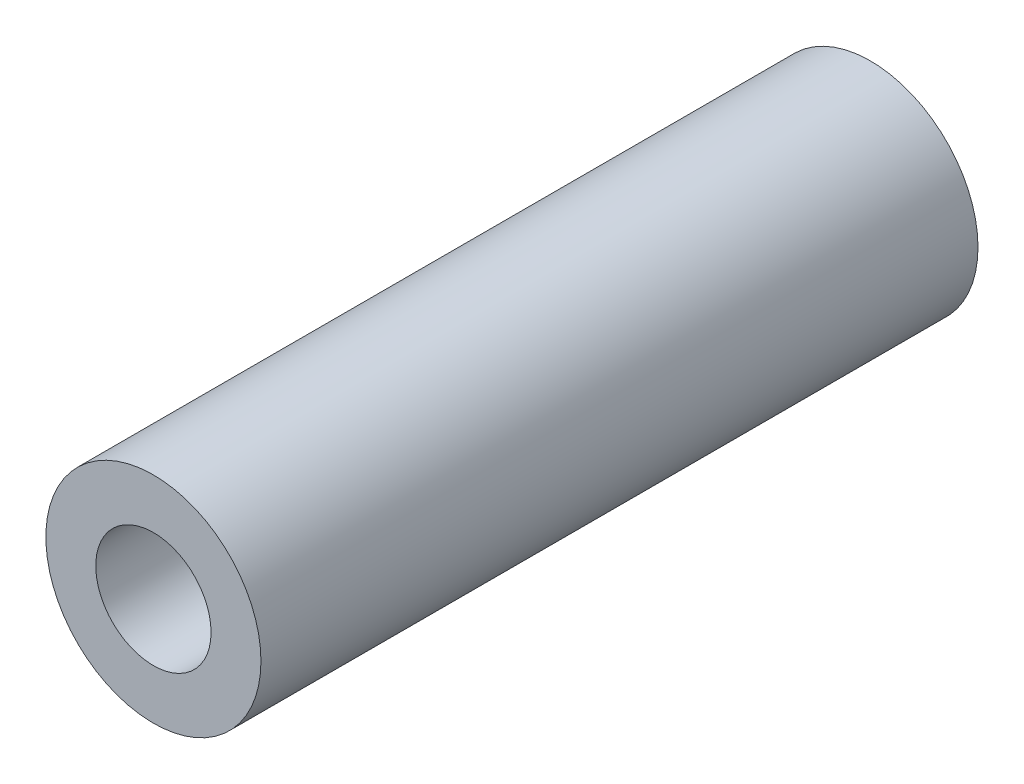
ISO-10303-21;
HEADER;
FILE_DESCRIPTION(('STEP AP214'),'2;1');
FILE_NAME('part.step','',(''),(''),'','','');
FILE_SCHEMA(('AUTOMOTIVE_DESIGN { 1 0 10303 214 1 1 1 1 }'));
ENDSEC;
DATA;
#1=APPLICATION_CONTEXT('core data for automotive mechanical design processes');
#2=APPLICATION_PROTOCOL_DEFINITION('international standard','automotive_design',2000,#1);
#3=PRODUCT_CONTEXT('',#1,'mechanical');
#4=PRODUCT('Part','Part','',(#3));
#5=PRODUCT_RELATED_PRODUCT_CATEGORY('part','',(#4));
#6=PRODUCT_DEFINITION_FORMATION('','',#4);
#7=PRODUCT_DEFINITION_CONTEXT('part definition',#1,'design');
#8=PRODUCT_DEFINITION('design','',#6,#7);
#9=PRODUCT_DEFINITION_SHAPE('','',#8);
#10=(LENGTH_UNIT() NAMED_UNIT(*) SI_UNIT(.MILLI.,.METRE.));
#11=(NAMED_UNIT(*) PLANE_ANGLE_UNIT() SI_UNIT($,.RADIAN.));
#12=(NAMED_UNIT(*) SI_UNIT($,.STERADIAN.) SOLID_ANGLE_UNIT());
#13=UNCERTAINTY_MEASURE_WITH_UNIT(LENGTH_MEASURE(1.E-05),#10,'distance_accuracy_value','');
#14=(GEOMETRIC_REPRESENTATION_CONTEXT(3) GLOBAL_UNCERTAINTY_ASSIGNED_CONTEXT((#13)) GLOBAL_UNIT_ASSIGNED_CONTEXT((#10,
#11,#12)) REPRESENTATION_CONTEXT('',''));
#15=CARTESIAN_POINT('',(0.,0.,0.));
#16=DIRECTION('',(0.,0.,1.));
#17=DIRECTION('',(1.,0.,0.));
#18=AXIS2_PLACEMENT_3D('',#15,#16,#17);
#19=CARTESIAN_POINT('',(0.,0.,0.));
#20=DIRECTION('',(0.,0.,1.));
#21=DIRECTION('',(1.,0.,0.));
#22=AXIS2_PLACEMENT_3D('',#19,#20,#21);
#23=CYLINDRICAL_SURFACE('',#22,2.5527);
#24=CARTESIAN_POINT('',(0.,0.,0.));
#25=DIRECTION('',(0.,0.,1.));
#26=DIRECTION('',(1.,0.,0.));
#27=AXIS2_PLACEMENT_3D('',#24,#25,#26);
#28=CIRCLE('',#27,2.5527);
#29=CARTESIAN_POINT('',(2.5527,0.,0.));
#30=VERTEX_POINT('',#29);
#31=EDGE_CURVE('E27',#30,#30,#28,.F.);
#32=ORIENTED_EDGE('',*,*,#31,.T.);
#33=EDGE_LOOP('',(#32));
#34=FACE_BOUND('',#33,.T.);
#35=CARTESIAN_POINT('',(0.,0.,31.75));
#36=DIRECTION('',(0.,0.,1.));
#37=DIRECTION('',(1.,0.,0.));
#38=AXIS2_PLACEMENT_3D('',#35,#36,#37);
#39=CIRCLE('',#38,2.5527);
#40=CARTESIAN_POINT('',(2.5527,0.,31.75));
#41=VERTEX_POINT('',#40);
#42=EDGE_CURVE('E18',#41,#41,#39,.F.);
#43=ORIENTED_EDGE('',*,*,#42,.F.);
#44=EDGE_LOOP('',(#43));
#45=FACE_BOUND('',#44,.T.);
#46=ADVANCED_FACE('F15',(#34,#45),#23,.F.);
#47=CARTESIAN_POINT('',(0.,0.,31.75));
#48=DIRECTION('',(0.,0.,1.));
#49=DIRECTION('',(1.,0.,0.));
#50=AXIS2_PLACEMENT_3D('',#47,#48,#49);
#51=PLANE('',#50);
#52=CARTESIAN_POINT('',(0.,0.,31.75));
#53=DIRECTION('',(0.,0.,1.));
#54=DIRECTION('',(1.,0.,0.));
#55=AXIS2_PLACEMENT_3D('',#52,#53,#54);
#56=CIRCLE('',#55,4.7625);
#57=CARTESIAN_POINT('',(4.7625,0.,31.75));
#58=VERTEX_POINT('',#57);
#59=EDGE_CURVE('E22',#58,#58,#56,.F.);
#60=ORIENTED_EDGE('',*,*,#59,.F.);
#61=EDGE_LOOP('',(#60));
#62=FACE_BOUND('',#61,.T.);
#63=ORIENTED_EDGE('',*,*,#42,.T.);
#64=EDGE_LOOP('',(#63));
#65=FACE_BOUND('',#64,.T.);
#66=ADVANCED_FACE('F35',(#62,#65),#51,.T.);
#67=CARTESIAN_POINT('',(0.,0.,0.));
#68=DIRECTION('',(0.,0.,1.));
#69=DIRECTION('',(1.,0.,0.));
#70=AXIS2_PLACEMENT_3D('',#67,#68,#69);
#71=PLANE('',#70);
#72=CARTESIAN_POINT('',(0.,0.,0.));
#73=DIRECTION('',(0.,0.,1.));
#74=DIRECTION('',(1.,0.,0.));
#75=AXIS2_PLACEMENT_3D('',#72,#73,#74);
#76=CIRCLE('',#75,4.7625);
#77=CARTESIAN_POINT('',(4.7625,0.,0.));
#78=VERTEX_POINT('',#77);
#79=EDGE_CURVE('E10',#78,#78,#76,.T.);
#80=ORIENTED_EDGE('',*,*,#79,.F.);
#81=EDGE_LOOP('',(#80));
#82=FACE_BOUND('',#81,.T.);
#83=ORIENTED_EDGE('',*,*,#31,.F.);
#84=EDGE_LOOP('',(#83));
#85=FACE_BOUND('',#84,.T.);
#86=ADVANCED_FACE('F42',(#82,#85),#71,.F.);
#87=CARTESIAN_POINT('',(0.,0.,0.));
#88=DIRECTION('',(0.,0.,1.));
#89=DIRECTION('',(1.,0.,0.));
#90=AXIS2_PLACEMENT_3D('',#87,#88,#89);
#91=CYLINDRICAL_SURFACE('',#90,4.7625);
#92=ORIENTED_EDGE('',*,*,#79,.T.);
#93=EDGE_LOOP('',(#92));
#94=FACE_BOUND('',#93,.T.);
#95=ORIENTED_EDGE('',*,*,#59,.T.);
#96=EDGE_LOOP('',(#95));
#97=FACE_BOUND('',#96,.T.);
#98=ADVANCED_FACE('F44',(#94,#97),#91,.T.);
#99=CLOSED_SHELL('',(#46,#66,#86,#98));
#100=MANIFOLD_SOLID_BREP('B1',#99);
#101=ADVANCED_BREP_SHAPE_REPRESENTATION('',(#18,#100),#14);
#102=SHAPE_DEFINITION_REPRESENTATION(#9,#101);
ENDSEC;
END-ISO-10303-21;
